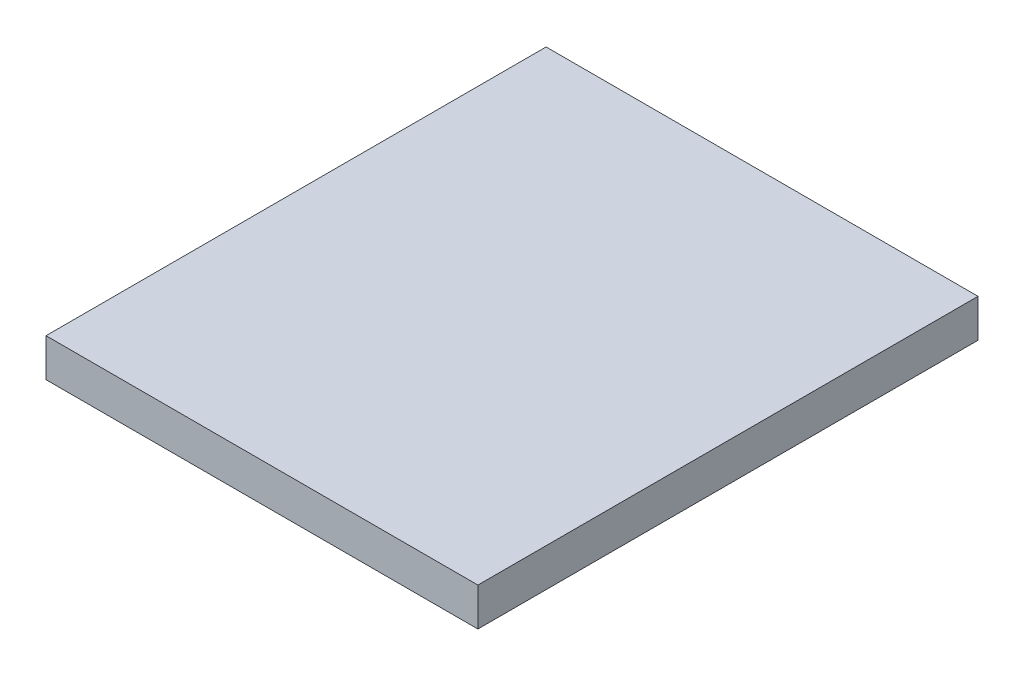
ISO-10303-21;
HEADER;
FILE_DESCRIPTION(('STEP AP214'),'2;1');
FILE_NAME('part.step','',(''),(''),'','','');
FILE_SCHEMA(('AUTOMOTIVE_DESIGN { 1 0 10303 214 1 1 1 1 }'));
ENDSEC;
DATA;
#1=APPLICATION_CONTEXT('core data for automotive mechanical design processes');
#2=APPLICATION_PROTOCOL_DEFINITION('international standard','automotive_design',2000,#1);
#3=PRODUCT_CONTEXT('',#1,'mechanical');
#4=PRODUCT('Part','Part','',(#3));
#5=PRODUCT_RELATED_PRODUCT_CATEGORY('part','',(#4));
#6=PRODUCT_DEFINITION_FORMATION('','',#4);
#7=PRODUCT_DEFINITION_CONTEXT('part definition',#1,'design');
#8=PRODUCT_DEFINITION('design','',#6,#7);
#9=PRODUCT_DEFINITION_SHAPE('','',#8);
#10=(LENGTH_UNIT() NAMED_UNIT(*) SI_UNIT(.MILLI.,.METRE.));
#11=(NAMED_UNIT(*) PLANE_ANGLE_UNIT() SI_UNIT($,.RADIAN.));
#12=(NAMED_UNIT(*) SI_UNIT($,.STERADIAN.) SOLID_ANGLE_UNIT());
#13=UNCERTAINTY_MEASURE_WITH_UNIT(LENGTH_MEASURE(1.E-05),#10,'distance_accuracy_value','');
#14=(GEOMETRIC_REPRESENTATION_CONTEXT(3) GLOBAL_UNCERTAINTY_ASSIGNED_CONTEXT((#13)) GLOBAL_UNIT_ASSIGNED_CONTEXT((#10,
#11,#12)) REPRESENTATION_CONTEXT('',''));
#15=CARTESIAN_POINT('',(0.,0.,0.));
#16=DIRECTION('',(0.,0.,1.));
#17=DIRECTION('',(1.,0.,0.));
#18=AXIS2_PLACEMENT_3D('',#15,#16,#17);
#19=CARTESIAN_POINT('',(-1.0795,0.09524999999996,2.50000008));
#20=DIRECTION('',(0.,0.,-1.));
#21=DIRECTION('',(0.,-1.,0.));
#22=AXIS2_PLACEMENT_3D('',#19,#20,#21);
#23=PLANE('',#22);
#24=DIRECTION('',(0.,-1.,0.));
#25=VECTOR('',#24,1.);
#26=CARTESIAN_POINT('',(-1.0795,0.09524999999996,2.50000008));
#27=LINE('',#26,#25);
#28=CARTESIAN_POINT('',(-1.0795,0.09524999999996,2.50000008));
#29=VERTEX_POINT('',#28);
#30=CARTESIAN_POINT('',(-1.0795,-0.09525000000008,2.50000008));
#31=VERTEX_POINT('',#30);
#32=EDGE_CURVE('E99',#29,#31,#27,.T.);
#33=ORIENTED_EDGE('',*,*,#32,.T.);
#34=DIRECTION('',(1.,0.,0.));
#35=VECTOR('',#34,1.);
#36=CARTESIAN_POINT('',(-1.0795,-0.09525000000008,2.50000008));
#37=LINE('',#36,#35);
#38=CARTESIAN_POINT('',(1.0795,-0.09525000000008,2.50000008));
#39=VERTEX_POINT('',#38);
#40=EDGE_CURVE('E78',#31,#39,#37,.T.);
#41=ORIENTED_EDGE('',*,*,#40,.T.);
#42=DIRECTION('',(0.,1.,0.));
#43=VECTOR('',#42,1.);
#44=CARTESIAN_POINT('',(1.0795,-0.09525000000008,2.50000008));
#45=LINE('',#44,#43);
#46=CARTESIAN_POINT('',(1.0795,0.09524999999996,2.50000008));
#47=VERTEX_POINT('',#46);
#48=EDGE_CURVE('E83',#39,#47,#45,.T.);
#49=ORIENTED_EDGE('',*,*,#48,.T.);
#50=DIRECTION('',(-1.,0.,0.));
#51=VECTOR('',#50,1.);
#52=CARTESIAN_POINT('',(1.0795,0.09524999999996,2.50000008));
#53=LINE('',#52,#51);
#54=EDGE_CURVE('E11',#47,#29,#53,.T.);
#55=ORIENTED_EDGE('',*,*,#54,.T.);
#56=EDGE_LOOP('',(#33,#41,#49,#55));
#57=FACE_BOUND('',#56,.T.);
#58=ADVANCED_FACE('F17',(#57),#23,.F.);
#59=CARTESIAN_POINT('',(-1.0795,0.09524999999996,0.));
#60=DIRECTION('',(0.,0.,-1.));
#61=DIRECTION('',(0.,-1.,0.));
#62=AXIS2_PLACEMENT_3D('',#59,#60,#61);
#63=PLANE('',#62);
#64=DIRECTION('',(-1.,0.,0.));
#65=VECTOR('',#64,1.);
#66=CARTESIAN_POINT('',(1.0795,0.09524999999996,0.));
#67=LINE('',#66,#65);
#68=CARTESIAN_POINT('',(1.0795,0.09524999999996,0.));
#69=VERTEX_POINT('',#68);
#70=CARTESIAN_POINT('',(-1.0795,0.09524999999996,0.));
#71=VERTEX_POINT('',#70);
#72=EDGE_CURVE('E20',#69,#71,#67,.T.);
#73=ORIENTED_EDGE('',*,*,#72,.F.);
#74=DIRECTION('',(0.,1.,0.));
#75=VECTOR('',#74,1.);
#76=CARTESIAN_POINT('',(1.0795,-0.09525000000008,0.));
#77=LINE('',#76,#75);
#78=CARTESIAN_POINT('',(1.0795,-0.09525000000008,0.));
#79=VERTEX_POINT('',#78);
#80=EDGE_CURVE('E68',#79,#69,#77,.T.);
#81=ORIENTED_EDGE('',*,*,#80,.F.);
#82=DIRECTION('',(1.,0.,0.));
#83=VECTOR('',#82,1.);
#84=CARTESIAN_POINT('',(-1.0795,-0.09525000000008,0.));
#85=LINE('',#84,#83);
#86=CARTESIAN_POINT('',(-1.0795,-0.09525000000008,0.));
#87=VERTEX_POINT('',#86);
#88=EDGE_CURVE('E72',#87,#79,#85,.T.);
#89=ORIENTED_EDGE('',*,*,#88,.F.);
#90=DIRECTION('',(0.,-1.,0.));
#91=VECTOR('',#90,1.);
#92=CARTESIAN_POINT('',(-1.0795,0.09524999999996,0.));
#93=LINE('',#92,#91);
#94=EDGE_CURVE('E113',#71,#87,#93,.T.);
#95=ORIENTED_EDGE('',*,*,#94,.F.);
#96=EDGE_LOOP('',(#73,#81,#89,#95));
#97=FACE_BOUND('',#96,.T.);
#98=ADVANCED_FACE('F70',(#97),#63,.T.);
#99=CARTESIAN_POINT('',(1.0795,0.09524999999996,0.));
#100=DIRECTION('',(0.,-1.,0.));
#101=DIRECTION('',(0.,0.,-1.));
#102=AXIS2_PLACEMENT_3D('',#99,#100,#101);
#103=PLANE('',#102);
#104=ORIENTED_EDGE('',*,*,#72,.T.);
#105=DIRECTION('',(0.,0.,1.));
#106=VECTOR('',#105,1.);
#107=CARTESIAN_POINT('',(-1.0795,0.09524999999996,0.));
#108=LINE('',#107,#106);
#109=EDGE_CURVE('E93',#71,#29,#108,.T.);
#110=ORIENTED_EDGE('',*,*,#109,.T.);
#111=ORIENTED_EDGE('',*,*,#54,.F.);
#112=DIRECTION('',(0.,0.,1.));
#113=VECTOR('',#112,1.);
#114=CARTESIAN_POINT('',(1.0795,0.09524999999996,0.));
#115=LINE('',#114,#113);
#116=EDGE_CURVE('E77',#69,#47,#115,.T.);
#117=ORIENTED_EDGE('',*,*,#116,.F.);
#118=EDGE_LOOP('',(#104,#110,#111,#117));
#119=FACE_BOUND('',#118,.T.);
#120=ADVANCED_FACE('F107',(#119),#103,.F.);
#121=CARTESIAN_POINT('',(1.0795,-0.09525000000008,0.));
#122=DIRECTION('',(-1.,0.,0.));
#123=DIRECTION('',(0.,0.,1.));
#124=AXIS2_PLACEMENT_3D('',#121,#122,#123);
#125=PLANE('',#124);
#126=ORIENTED_EDGE('',*,*,#80,.T.);
#127=ORIENTED_EDGE('',*,*,#116,.T.);
#128=ORIENTED_EDGE('',*,*,#48,.F.);
#129=DIRECTION('',(0.,0.,1.));
#130=VECTOR('',#129,1.);
#131=CARTESIAN_POINT('',(1.0795,-0.09525000000008,0.));
#132=LINE('',#131,#130);
#133=EDGE_CURVE('E81',#79,#39,#132,.T.);
#134=ORIENTED_EDGE('',*,*,#133,.F.);
#135=EDGE_LOOP('',(#126,#127,#128,#134));
#136=FACE_BOUND('',#135,.T.);
#137=ADVANCED_FACE('F82',(#136),#125,.F.);
#138=CARTESIAN_POINT('',(-1.0795,-0.09525000000008,0.));
#139=DIRECTION('',(0.,1.,0.));
#140=DIRECTION('',(1.,0.,0.));
#141=AXIS2_PLACEMENT_3D('',#138,#139,#140);
#142=PLANE('',#141);
#143=ORIENTED_EDGE('',*,*,#88,.T.);
#144=ORIENTED_EDGE('',*,*,#133,.T.);
#145=ORIENTED_EDGE('',*,*,#40,.F.);
#146=DIRECTION('',(0.,0.,1.));
#147=VECTOR('',#146,1.);
#148=CARTESIAN_POINT('',(-1.0795,-0.09525000000008,0.));
#149=LINE('',#148,#147);
#150=EDGE_CURVE('E90',#87,#31,#149,.T.);
#151=ORIENTED_EDGE('',*,*,#150,.F.);
#152=EDGE_LOOP('',(#143,#144,#145,#151));
#153=FACE_BOUND('',#152,.T.);
#154=ADVANCED_FACE('F88',(#153),#142,.F.);
#155=CARTESIAN_POINT('',(-1.0795,0.09524999999996,0.));
#156=DIRECTION('',(1.,0.,0.));
#157=DIRECTION('',(0.,1.,0.));
#158=AXIS2_PLACEMENT_3D('',#155,#156,#157);
#159=PLANE('',#158);
#160=ORIENTED_EDGE('',*,*,#94,.T.);
#161=ORIENTED_EDGE('',*,*,#150,.T.);
#162=ORIENTED_EDGE('',*,*,#32,.F.);
#163=ORIENTED_EDGE('',*,*,#109,.F.);
#164=EDGE_LOOP('',(#160,#161,#162,#163));
#165=FACE_BOUND('',#164,.T.);
#166=ADVANCED_FACE('F112',(#165),#159,.F.);
#167=CLOSED_SHELL('',(#58,#98,#120,#137,#154,#166));
#168=MANIFOLD_SOLID_BREP('B1',#167);
#169=ADVANCED_BREP_SHAPE_REPRESENTATION('',(#18,#168),#14);
#170=SHAPE_DEFINITION_REPRESENTATION(#9,#169);
ENDSEC;
END-ISO-10303-21;
